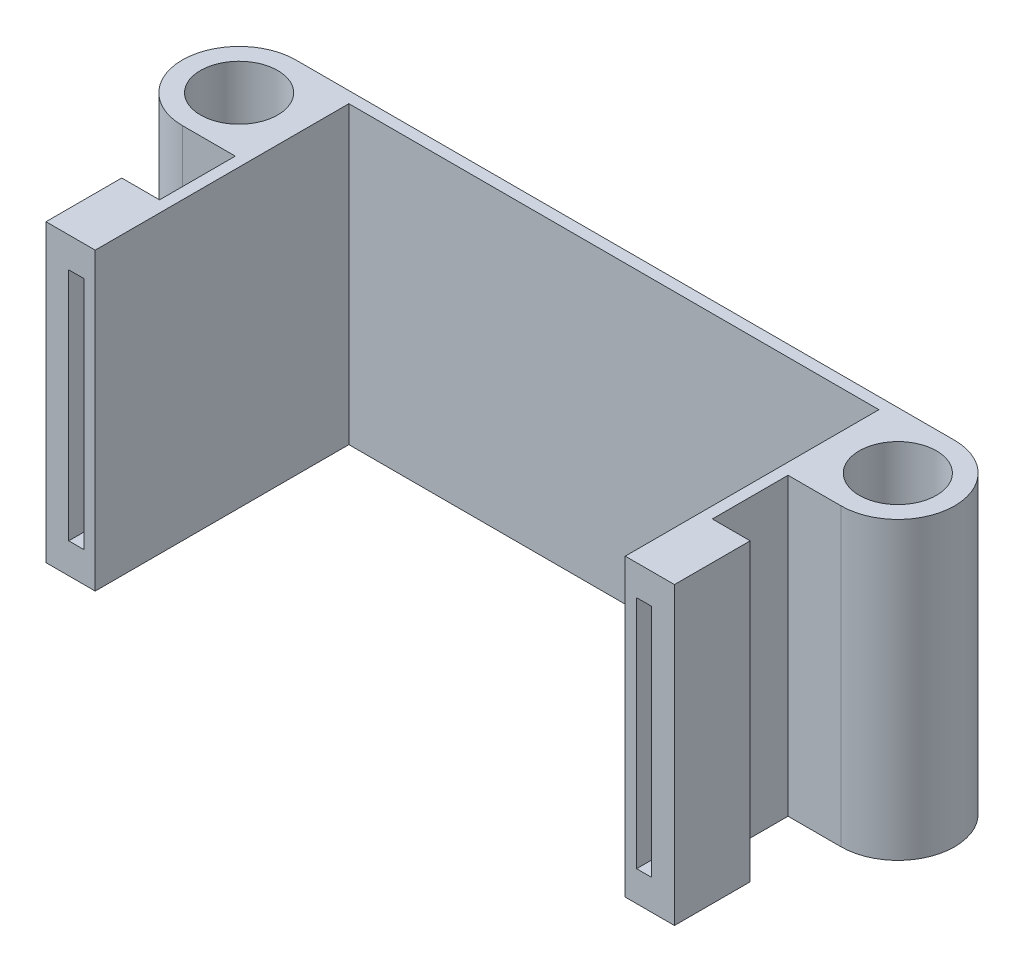
ISO-10303-21;
HEADER;
FILE_DESCRIPTION(('STEP AP214'),'2;1');
FILE_NAME('part.step','',(''),(''),'','','');
FILE_SCHEMA(('AUTOMOTIVE_DESIGN { 1 0 10303 214 1 1 1 1 }'));
ENDSEC;
DATA;
#1=APPLICATION_CONTEXT('core data for automotive mechanical design processes');
#2=APPLICATION_PROTOCOL_DEFINITION('international standard','automotive_design',2000,#1);
#3=PRODUCT_CONTEXT('',#1,'mechanical');
#4=PRODUCT('Part','Part','',(#3));
#5=PRODUCT_RELATED_PRODUCT_CATEGORY('part','',(#4));
#6=PRODUCT_DEFINITION_FORMATION('','',#4);
#7=PRODUCT_DEFINITION_CONTEXT('part definition',#1,'design');
#8=PRODUCT_DEFINITION('design','',#6,#7);
#9=PRODUCT_DEFINITION_SHAPE('','',#8);
#10=(LENGTH_UNIT() NAMED_UNIT(*) SI_UNIT(.MILLI.,.METRE.));
#11=(NAMED_UNIT(*) PLANE_ANGLE_UNIT() SI_UNIT($,.RADIAN.));
#12=(NAMED_UNIT(*) SI_UNIT($,.STERADIAN.) SOLID_ANGLE_UNIT());
#13=UNCERTAINTY_MEASURE_WITH_UNIT(LENGTH_MEASURE(1.E-05),#10,'distance_accuracy_value','');
#14=(GEOMETRIC_REPRESENTATION_CONTEXT(3) GLOBAL_UNCERTAINTY_ASSIGNED_CONTEXT((#13)) GLOBAL_UNIT_ASSIGNED_CONTEXT((#10,
#11,#12)) REPRESENTATION_CONTEXT('',''));
#15=CARTESIAN_POINT('',(0.,0.,0.));
#16=DIRECTION('',(0.,0.,1.));
#17=DIRECTION('',(1.,0.,0.));
#18=AXIS2_PLACEMENT_3D('',#15,#16,#17);
#19=CARTESIAN_POINT('',(0.,19.5,8.75));
#20=DIRECTION('',(0.,0.,-1.));
#21=DIRECTION('',(-1.,0.,0.));
#22=AXIS2_PLACEMENT_3D('',#19,#20,#21);
#23=PLANE('',#22);
#24=DIRECTION('',(-1.,0.,0.));
#25=VECTOR('',#24,1.);
#26=CARTESIAN_POINT('',(3.5,17.5,8.75));
#27=LINE('',#26,#25);
#28=CARTESIAN_POINT('',(3.5,17.5,8.75));
#29=VERTEX_POINT('',#28);
#30=CARTESIAN_POINT('',(2.5,17.5,8.75));
#31=VERTEX_POINT('',#30);
#32=EDGE_CURVE('E219',#29,#31,#27,.T.);
#33=ORIENTED_EDGE('',*,*,#32,.T.);
#34=DIRECTION('',(0.,-1.,0.));
#35=VECTOR('',#34,1.);
#36=CARTESIAN_POINT('',(2.5,17.5,8.75));
#37=LINE('',#36,#35);
#38=CARTESIAN_POINT('',(2.5,2.,8.75));
#39=VERTEX_POINT('',#38);
#40=EDGE_CURVE('E204',#31,#39,#37,.T.);
#41=ORIENTED_EDGE('',*,*,#40,.T.);
#42=DIRECTION('',(1.,0.,0.));
#43=VECTOR('',#42,1.);
#44=CARTESIAN_POINT('',(3.5,2.,8.75));
#45=LINE('',#44,#43);
#46=CARTESIAN_POINT('',(3.5,2.,8.75));
#47=VERTEX_POINT('',#46);
#48=EDGE_CURVE('E238',#39,#47,#45,.T.);
#49=ORIENTED_EDGE('',*,*,#48,.T.);
#50=DIRECTION('',(0.,-1.,0.));
#51=VECTOR('',#50,1.);
#52=CARTESIAN_POINT('',(3.5,19.5,8.75));
#53=LINE('',#52,#51);
#54=CARTESIAN_POINT('',(3.5,0.,8.75));
#55=VERTEX_POINT('',#54);
#56=EDGE_CURVE('E352',#47,#55,#53,.T.);
#57=ORIENTED_EDGE('',*,*,#56,.T.);
#58=DIRECTION('',(1.,0.,0.));
#59=VECTOR('',#58,1.);
#60=CARTESIAN_POINT('',(0.,0.,8.75));
#61=LINE('',#60,#59);
#62=CARTESIAN_POINT('',(0.999999999999997,0.,8.75));
#63=VERTEX_POINT('',#62);
#64=EDGE_CURVE('E249',#63,#55,#61,.T.);
#65=ORIENTED_EDGE('',*,*,#64,.F.);
#66=DIRECTION('',(0.,-1.,0.));
#67=VECTOR('',#66,1.);
#68=CARTESIAN_POINT('',(0.999999999999997,19.5,8.75));
#69=LINE('',#68,#67);
#70=CARTESIAN_POINT('',(0.999999999999997,19.5,8.75));
#71=VERTEX_POINT('',#70);
#72=EDGE_CURVE('E11',#71,#63,#69,.T.);
#73=ORIENTED_EDGE('',*,*,#72,.F.);
#74=DIRECTION('',(1.,0.,0.));
#75=VECTOR('',#74,1.);
#76=CARTESIAN_POINT('',(0.,19.5,8.75));
#77=LINE('',#76,#75);
#78=CARTESIAN_POINT('',(3.5,19.5,8.75));
#79=VERTEX_POINT('',#78);
#80=EDGE_CURVE('E288',#71,#79,#77,.T.);
#81=ORIENTED_EDGE('',*,*,#80,.T.);
#82=EDGE_CURVE('E228',#79,#29,#53,.T.);
#83=ORIENTED_EDGE('',*,*,#82,.T.);
#84=EDGE_LOOP('',(#33,#41,#49,#57,#65,#73,#81,#83));
#85=FACE_BOUND('',#84,.T.);
#86=ADVANCED_FACE('F43',(#85),#23,.T.);
#87=CARTESIAN_POINT('',(0.999999999999997,19.5,0.));
#88=DIRECTION('',(-1.,0.,0.));
#89=DIRECTION('',(0.,0.,1.));
#90=AXIS2_PLACEMENT_3D('',#87,#88,#89);
#91=PLANE('',#90);
#92=DIRECTION('',(0.,0.,-1.));
#93=VECTOR('',#92,1.);
#94=CARTESIAN_POINT('',(0.999999999999997,0.,0.));
#95=LINE('',#94,#93);
#96=CARTESIAN_POINT('',(0.999999999999998,0.,13.75));
#97=VERTEX_POINT('',#96);
#98=EDGE_CURVE('E356',#97,#63,#95,.T.);
#99=ORIENTED_EDGE('',*,*,#98,.F.);
#100=DIRECTION('',(0.,-1.,0.));
#101=VECTOR('',#100,1.);
#102=CARTESIAN_POINT('',(0.999999999999998,19.5,13.75));
#103=LINE('',#102,#101);
#104=CARTESIAN_POINT('',(0.999999999999998,19.5,13.75));
#105=VERTEX_POINT('',#104);
#106=EDGE_CURVE('E51',#105,#97,#103,.T.);
#107=ORIENTED_EDGE('',*,*,#106,.F.);
#108=DIRECTION('',(0.,0.,-1.));
#109=VECTOR('',#108,1.);
#110=CARTESIAN_POINT('',(0.999999999999997,19.5,0.));
#111=LINE('',#110,#109);
#112=EDGE_CURVE('E291',#105,#71,#111,.T.);
#113=ORIENTED_EDGE('',*,*,#112,.T.);
#114=ORIENTED_EDGE('',*,*,#72,.T.);
#115=EDGE_LOOP('',(#99,#107,#113,#114));
#116=FACE_BOUND('',#115,.T.);
#117=ADVANCED_FACE('F473',(#116),#91,.T.);
#118=CARTESIAN_POINT('',(0.,19.5,13.75));
#119=DIRECTION('',(0.,0.,1.));
#120=DIRECTION('',(1.,0.,0.));
#121=AXIS2_PLACEMENT_3D('',#118,#119,#120);
#122=PLANE('',#121);
#123=DIRECTION('',(-1.,0.,0.));
#124=VECTOR('',#123,1.);
#125=CARTESIAN_POINT('',(3.5,17.5,13.75));
#126=LINE('',#125,#124);
#127=CARTESIAN_POINT('',(3.5,17.5,13.75));
#128=VERTEX_POINT('',#127);
#129=CARTESIAN_POINT('',(2.5,17.5,13.75));
#130=VERTEX_POINT('',#129);
#131=EDGE_CURVE('E222',#128,#130,#126,.T.);
#132=ORIENTED_EDGE('',*,*,#131,.F.);
#133=DIRECTION('',(0.,1.,0.));
#134=VECTOR('',#133,1.);
#135=CARTESIAN_POINT('',(3.5,17.5,13.75));
#136=LINE('',#135,#134);
#137=CARTESIAN_POINT('',(3.5,2.,13.75));
#138=VERTEX_POINT('',#137);
#139=EDGE_CURVE('E236',#138,#128,#136,.T.);
#140=ORIENTED_EDGE('',*,*,#139,.F.);
#141=DIRECTION('',(1.,0.,0.));
#142=VECTOR('',#141,1.);
#143=CARTESIAN_POINT('',(3.5,2.,13.75));
#144=LINE('',#143,#142);
#145=CARTESIAN_POINT('',(2.5,2.,13.75));
#146=VERTEX_POINT('',#145);
#147=EDGE_CURVE('E58',#146,#138,#144,.T.);
#148=ORIENTED_EDGE('',*,*,#147,.F.);
#149=DIRECTION('',(0.,-1.,0.));
#150=VECTOR('',#149,1.);
#151=CARTESIAN_POINT('',(2.5,17.5,13.75));
#152=LINE('',#151,#150);
#153=EDGE_CURVE('E232',#130,#146,#152,.T.);
#154=ORIENTED_EDGE('',*,*,#153,.F.);
#155=EDGE_LOOP('',(#132,#140,#148,#154));
#156=FACE_BOUND('',#155,.T.);
#157=DIRECTION('',(-1.,0.,0.));
#158=VECTOR('',#157,1.);
#159=CARTESIAN_POINT('',(0.,0.,13.75));
#160=LINE('',#159,#158);
#161=CARTESIAN_POINT('',(4.25,0.,13.75));
#162=VERTEX_POINT('',#161);
#163=EDGE_CURVE('E360',#162,#97,#160,.T.);
#164=ORIENTED_EDGE('',*,*,#163,.F.);
#165=DIRECTION('',(0.,-1.,0.));
#166=VECTOR('',#165,1.);
#167=CARTESIAN_POINT('',(4.25,19.5,13.75));
#168=LINE('',#167,#166);
#169=CARTESIAN_POINT('',(4.25,19.5,13.75));
#170=VERTEX_POINT('',#169);
#171=EDGE_CURVE('E463',#170,#162,#168,.T.);
#172=ORIENTED_EDGE('',*,*,#171,.F.);
#173=DIRECTION('',(-1.,0.,0.));
#174=VECTOR('',#173,1.);
#175=CARTESIAN_POINT('',(0.,19.5,13.75));
#176=LINE('',#175,#174);
#177=EDGE_CURVE('E296',#170,#105,#176,.T.);
#178=ORIENTED_EDGE('',*,*,#177,.T.);
#179=ORIENTED_EDGE('',*,*,#106,.T.);
#180=EDGE_LOOP('',(#164,#172,#178,#179));
#181=FACE_BOUND('',#180,.T.);
#182=ADVANCED_FACE('F469',(#156,#181),#122,.T.);
#183=CARTESIAN_POINT('',(4.25,19.5,0.));
#184=DIRECTION('',(1.,0.,0.));
#185=DIRECTION('',(0.,0.,-1.));
#186=AXIS2_PLACEMENT_3D('',#183,#184,#185);
#187=PLANE('',#186);
#188=DIRECTION('',(0.,0.,1.));
#189=VECTOR('',#188,1.);
#190=CARTESIAN_POINT('',(4.25,0.,0.));
#191=LINE('',#190,#189);
#192=CARTESIAN_POINT('',(4.25,0.,-2.99999999999993));
#193=VERTEX_POINT('',#192);
#194=EDGE_CURVE('E364',#193,#162,#191,.T.);
#195=ORIENTED_EDGE('',*,*,#194,.F.);
#196=DIRECTION('',(0.,-1.,0.));
#197=VECTOR('',#196,1.);
#198=CARTESIAN_POINT('',(4.25,19.5,-2.99999999999993));
#199=LINE('',#198,#197);
#200=CARTESIAN_POINT('',(4.25,19.5,-2.99999999999993));
#201=VERTEX_POINT('',#200);
#202=EDGE_CURVE('E460',#201,#193,#199,.T.);
#203=ORIENTED_EDGE('',*,*,#202,.F.);
#204=DIRECTION('',(0.,0.,1.));
#205=VECTOR('',#204,1.);
#206=CARTESIAN_POINT('',(4.25,19.5,0.));
#207=LINE('',#206,#205);
#208=EDGE_CURVE('E300',#201,#170,#207,.T.);
#209=ORIENTED_EDGE('',*,*,#208,.T.);
#210=ORIENTED_EDGE('',*,*,#171,.T.);
#211=EDGE_LOOP('',(#195,#203,#209,#210));
#212=FACE_BOUND('',#211,.T.);
#213=ADVANCED_FACE('F482',(#212),#187,.T.);
#214=CARTESIAN_POINT('',(0.,19.5,-2.99999999999993));
#215=DIRECTION('',(0.,0.,-1.));
#216=DIRECTION('',(-1.,0.,0.));
#217=AXIS2_PLACEMENT_3D('',#214,#215,#216);
#218=PLANE('',#217);
#219=DIRECTION('',(1.,0.,0.));
#220=VECTOR('',#219,1.);
#221=CARTESIAN_POINT('',(0.,0.,-2.99999999999993));
#222=LINE('',#221,#220);
#223=CARTESIAN_POINT('',(39.25,0.,-2.99999999999993));
#224=VERTEX_POINT('',#223);
#225=EDGE_CURVE('E368',#193,#224,#222,.T.);
#226=ORIENTED_EDGE('',*,*,#225,.T.);
#227=DIRECTION('',(0.,-1.,0.));
#228=VECTOR('',#227,1.);
#229=CARTESIAN_POINT('',(39.25,19.5,-2.99999999999993));
#230=LINE('',#229,#228);
#231=CARTESIAN_POINT('',(39.25,19.5,-2.99999999999993));
#232=VERTEX_POINT('',#231);
#233=EDGE_CURVE('E456',#232,#224,#230,.T.);
#234=ORIENTED_EDGE('',*,*,#233,.F.);
#235=DIRECTION('',(1.,0.,0.));
#236=VECTOR('',#235,1.);
#237=CARTESIAN_POINT('',(0.,19.5,-2.99999999999993));
#238=LINE('',#237,#236);
#239=EDGE_CURVE('E304',#201,#232,#238,.T.);
#240=ORIENTED_EDGE('',*,*,#239,.F.);
#241=ORIENTED_EDGE('',*,*,#202,.T.);
#242=EDGE_LOOP('',(#226,#234,#240,#241));
#243=FACE_BOUND('',#242,.T.);
#244=ADVANCED_FACE('F539',(#243),#218,.F.);
#245=CARTESIAN_POINT('',(39.25,19.5,0.));
#246=DIRECTION('',(1.,0.,0.));
#247=DIRECTION('',(0.,0.,-1.));
#248=AXIS2_PLACEMENT_3D('',#245,#246,#247);
#249=PLANE('',#248);
#250=DIRECTION('',(0.,0.,1.));
#251=VECTOR('',#250,1.);
#252=CARTESIAN_POINT('',(39.25,0.,0.));
#253=LINE('',#252,#251);
#254=CARTESIAN_POINT('',(39.25,0.,13.75));
#255=VERTEX_POINT('',#254);
#256=EDGE_CURVE('E371',#224,#255,#253,.T.);
#257=ORIENTED_EDGE('',*,*,#256,.T.);
#258=DIRECTION('',(0.,-1.,0.));
#259=VECTOR('',#258,1.);
#260=CARTESIAN_POINT('',(39.25,19.5,13.75));
#261=LINE('',#260,#259);
#262=CARTESIAN_POINT('',(39.25,19.5,13.75));
#263=VERTEX_POINT('',#262);
#264=EDGE_CURVE('E453',#263,#255,#261,.T.);
#265=ORIENTED_EDGE('',*,*,#264,.F.);
#266=DIRECTION('',(0.,0.,1.));
#267=VECTOR('',#266,1.);
#268=CARTESIAN_POINT('',(39.25,19.5,0.));
#269=LINE('',#268,#267);
#270=EDGE_CURVE('E307',#232,#263,#269,.T.);
#271=ORIENTED_EDGE('',*,*,#270,.F.);
#272=ORIENTED_EDGE('',*,*,#233,.T.);
#273=EDGE_LOOP('',(#257,#265,#271,#272));
#274=FACE_BOUND('',#273,.T.);
#275=ADVANCED_FACE('F536',(#274),#249,.F.);
#276=CARTESIAN_POINT('',(0.,19.5,13.75));
#277=DIRECTION('',(0.,0.,1.));
#278=DIRECTION('',(1.,0.,0.));
#279=AXIS2_PLACEMENT_3D('',#276,#277,#278);
#280=PLANE('',#279);
#281=DIRECTION('',(-1.,0.,0.));
#282=VECTOR('',#281,1.);
#283=CARTESIAN_POINT('',(41.,17.5,13.75));
#284=LINE('',#283,#282);
#285=CARTESIAN_POINT('',(41.,17.5,13.75));
#286=VERTEX_POINT('',#285);
#287=CARTESIAN_POINT('',(40.,17.5,13.75));
#288=VERTEX_POINT('',#287);
#289=EDGE_CURVE('E257',#286,#288,#284,.T.);
#290=ORIENTED_EDGE('',*,*,#289,.F.);
#291=DIRECTION('',(0.,1.,0.));
#292=VECTOR('',#291,1.);
#293=CARTESIAN_POINT('',(41.,17.5,13.75));
#294=LINE('',#293,#292);
#295=CARTESIAN_POINT('',(41.,2.,13.75));
#296=VERTEX_POINT('',#295);
#297=EDGE_CURVE('E261',#296,#286,#294,.T.);
#298=ORIENTED_EDGE('',*,*,#297,.F.);
#299=DIRECTION('',(1.,0.,0.));
#300=VECTOR('',#299,1.);
#301=CARTESIAN_POINT('',(41.,2.,13.75));
#302=LINE('',#301,#300);
#303=CARTESIAN_POINT('',(40.,2.,13.75));
#304=VERTEX_POINT('',#303);
#305=EDGE_CURVE('E66',#304,#296,#302,.T.);
#306=ORIENTED_EDGE('',*,*,#305,.F.);
#307=DIRECTION('',(0.,-1.,0.));
#308=VECTOR('',#307,1.);
#309=CARTESIAN_POINT('',(40.,17.5,13.75));
#310=LINE('',#309,#308);
#311=EDGE_CURVE('E253',#288,#304,#310,.T.);
#312=ORIENTED_EDGE('',*,*,#311,.F.);
#313=EDGE_LOOP('',(#290,#298,#306,#312));
#314=FACE_BOUND('',#313,.T.);
#315=DIRECTION('',(-1.,0.,0.));
#316=VECTOR('',#315,1.);
#317=CARTESIAN_POINT('',(0.,0.,13.75));
#318=LINE('',#317,#316);
#319=CARTESIAN_POINT('',(42.5,0.,13.75));
#320=VERTEX_POINT('',#319);
#321=EDGE_CURVE('E375',#320,#255,#318,.T.);
#322=ORIENTED_EDGE('',*,*,#321,.F.);
#323=DIRECTION('',(0.,-1.,0.));
#324=VECTOR('',#323,1.);
#325=CARTESIAN_POINT('',(42.5,19.5,13.75));
#326=LINE('',#325,#324);
#327=CARTESIAN_POINT('',(42.5,19.5,13.75));
#328=VERTEX_POINT('',#327);
#329=EDGE_CURVE('E450',#328,#320,#326,.T.);
#330=ORIENTED_EDGE('',*,*,#329,.F.);
#331=DIRECTION('',(-1.,0.,0.));
#332=VECTOR('',#331,1.);
#333=CARTESIAN_POINT('',(0.,19.5,13.75));
#334=LINE('',#333,#332);
#335=EDGE_CURVE('E310',#328,#263,#334,.T.);
#336=ORIENTED_EDGE('',*,*,#335,.T.);
#337=ORIENTED_EDGE('',*,*,#264,.T.);
#338=EDGE_LOOP('',(#322,#330,#336,#337));
#339=FACE_BOUND('',#338,.T.);
#340=ADVANCED_FACE('F530',(#314,#339),#280,.T.);
#341=CARTESIAN_POINT('',(42.5,19.5,0.));
#342=DIRECTION('',(-1.,0.,0.));
#343=DIRECTION('',(0.,0.,1.));
#344=AXIS2_PLACEMENT_3D('',#341,#342,#343);
#345=PLANE('',#344);
#346=DIRECTION('',(0.,0.,-1.));
#347=VECTOR('',#346,1.);
#348=CARTESIAN_POINT('',(42.5,0.,0.));
#349=LINE('',#348,#347);
#350=CARTESIAN_POINT('',(42.5,0.,8.75));
#351=VERTEX_POINT('',#350);
#352=EDGE_CURVE('E379',#320,#351,#349,.T.);
#353=ORIENTED_EDGE('',*,*,#352,.T.);
#354=DIRECTION('',(0.,-1.,0.));
#355=VECTOR('',#354,1.);
#356=CARTESIAN_POINT('',(42.5,19.5,8.75));
#357=LINE('',#356,#355);
#358=CARTESIAN_POINT('',(42.5,19.5,8.75));
#359=VERTEX_POINT('',#358);
#360=EDGE_CURVE('E446',#359,#351,#357,.T.);
#361=ORIENTED_EDGE('',*,*,#360,.F.);
#362=DIRECTION('',(0.,0.,-1.));
#363=VECTOR('',#362,1.);
#364=CARTESIAN_POINT('',(42.5,19.5,0.));
#365=LINE('',#364,#363);
#366=EDGE_CURVE('E314',#328,#359,#365,.T.);
#367=ORIENTED_EDGE('',*,*,#366,.F.);
#368=ORIENTED_EDGE('',*,*,#329,.T.);
#369=EDGE_LOOP('',(#353,#361,#367,#368));
#370=FACE_BOUND('',#369,.T.);
#371=ADVANCED_FACE('F542',(#370),#345,.F.);
#372=CARTESIAN_POINT('',(0.,19.5,8.75));
#373=DIRECTION('',(0.,0.,1.));
#374=DIRECTION('',(1.,0.,0.));
#375=AXIS2_PLACEMENT_3D('',#372,#373,#374);
#376=PLANE('',#375);
#377=DIRECTION('',(0.,1.,0.));
#378=VECTOR('',#377,1.);
#379=CARTESIAN_POINT('',(41.,17.5,8.75));
#380=LINE('',#379,#378);
#381=CARTESIAN_POINT('',(41.,2.,8.75));
#382=VERTEX_POINT('',#381);
#383=CARTESIAN_POINT('',(41.,17.5,8.75));
#384=VERTEX_POINT('',#383);
#385=EDGE_CURVE('E269',#382,#384,#380,.T.);
#386=ORIENTED_EDGE('',*,*,#385,.T.);
#387=DIRECTION('',(-1.,0.,0.));
#388=VECTOR('',#387,1.);
#389=CARTESIAN_POINT('',(41.,17.5,8.75));
#390=LINE('',#389,#388);
#391=CARTESIAN_POINT('',(40.,17.5,8.75));
#392=VERTEX_POINT('',#391);
#393=EDGE_CURVE('E252',#384,#392,#390,.T.);
#394=ORIENTED_EDGE('',*,*,#393,.T.);
#395=DIRECTION('',(0.,-1.,0.));
#396=VECTOR('',#395,1.);
#397=CARTESIAN_POINT('',(40.,19.5,8.75));
#398=LINE('',#397,#396);
#399=CARTESIAN_POINT('',(40.,19.5,8.75));
#400=VERTEX_POINT('',#399);
#401=EDGE_CURVE('E442',#400,#392,#398,.T.);
#402=ORIENTED_EDGE('',*,*,#401,.F.);
#403=DIRECTION('',(-1.,0.,0.));
#404=VECTOR('',#403,1.);
#405=CARTESIAN_POINT('',(0.,19.5,8.75));
#406=LINE('',#405,#404);
#407=EDGE_CURVE('E317',#359,#400,#406,.T.);
#408=ORIENTED_EDGE('',*,*,#407,.F.);
#409=ORIENTED_EDGE('',*,*,#360,.T.);
#410=DIRECTION('',(-1.,0.,0.));
#411=VECTOR('',#410,1.);
#412=CARTESIAN_POINT('',(0.,0.,8.75));
#413=LINE('',#412,#411);
#414=CARTESIAN_POINT('',(40.,0.,8.75));
#415=VERTEX_POINT('',#414);
#416=EDGE_CURVE('E382',#351,#415,#413,.T.);
#417=ORIENTED_EDGE('',*,*,#416,.T.);
#418=CARTESIAN_POINT('',(40.,2.,8.75));
#419=VERTEX_POINT('',#418);
#420=EDGE_CURVE('E441',#419,#415,#398,.T.);
#421=ORIENTED_EDGE('',*,*,#420,.F.);
#422=DIRECTION('',(1.,0.,0.));
#423=VECTOR('',#422,1.);
#424=CARTESIAN_POINT('',(41.,2.,8.75));
#425=LINE('',#424,#423);
#426=EDGE_CURVE('E275',#419,#382,#425,.T.);
#427=ORIENTED_EDGE('',*,*,#426,.T.);
#428=EDGE_LOOP('',(#386,#394,#402,#408,#409,#417,#421,#427));
#429=FACE_BOUND('',#428,.T.);
#430=ADVANCED_FACE('F523',(#429),#376,.F.);
#431=CARTESIAN_POINT('',(40.,19.5,0.));
#432=DIRECTION('',(1.,0.,0.));
#433=DIRECTION('',(0.,0.,-1.));
#434=AXIS2_PLACEMENT_3D('',#431,#432,#433);
#435=PLANE('',#434);
#436=DIRECTION('',(0.,0.,1.));
#437=VECTOR('',#436,1.);
#438=CARTESIAN_POINT('',(40.,0.,0.));
#439=LINE('',#438,#437);
#440=CARTESIAN_POINT('',(40.,0.,3.75));
#441=VERTEX_POINT('',#440);
#442=EDGE_CURVE('E386',#441,#415,#439,.T.);
#443=ORIENTED_EDGE('',*,*,#442,.F.);
#444=DIRECTION('',(0.,-1.,0.));
#445=VECTOR('',#444,1.);
#446=CARTESIAN_POINT('',(40.,19.5,3.75));
#447=LINE('',#446,#445);
#448=CARTESIAN_POINT('',(40.,19.5,3.75));
#449=VERTEX_POINT('',#448);
#450=EDGE_CURVE('E438',#449,#441,#447,.T.);
#451=ORIENTED_EDGE('',*,*,#450,.F.);
#452=DIRECTION('',(0.,0.,1.));
#453=VECTOR('',#452,1.);
#454=CARTESIAN_POINT('',(40.,19.5,0.));
#455=LINE('',#454,#453);
#456=EDGE_CURVE('E320',#449,#400,#455,.T.);
#457=ORIENTED_EDGE('',*,*,#456,.T.);
#458=ORIENTED_EDGE('',*,*,#401,.T.);
#459=DIRECTION('',(0.,0.,1.));
#460=VECTOR('',#459,1.);
#461=CARTESIAN_POINT('',(40.,17.5,-6.78222456700907));
#462=LINE('',#461,#460);
#463=EDGE_CURVE('E268',#392,#288,#462,.T.);
#464=ORIENTED_EDGE('',*,*,#463,.T.);
#465=ORIENTED_EDGE('',*,*,#311,.T.);
#466=DIRECTION('',(0.,0.,1.));
#467=VECTOR('',#466,1.);
#468=CARTESIAN_POINT('',(40.,2.,-6.78222456700907));
#469=LINE('',#468,#467);
#470=EDGE_CURVE('E279',#419,#304,#469,.T.);
#471=ORIENTED_EDGE('',*,*,#470,.F.);
#472=ORIENTED_EDGE('',*,*,#420,.T.);
#473=EDGE_LOOP('',(#443,#451,#457,#458,#464,#465,#471,#472));
#474=FACE_BOUND('',#473,.T.);
#475=ADVANCED_FACE('F517',(#474),#435,.T.);
#476=CARTESIAN_POINT('',(0.,19.5,3.74999999999938));
#477=DIRECTION('',(0.,0.,-1.));
#478=DIRECTION('',(-1.,0.,0.));
#479=AXIS2_PLACEMENT_3D('',#476,#477,#478);
#480=PLANE('',#479);
#481=DIRECTION('',(1.,0.,0.));
#482=VECTOR('',#481,1.);
#483=CARTESIAN_POINT('',(0.,0.,3.74999999999938));
#484=LINE('',#483,#482);
#485=CARTESIAN_POINT('',(43.5000000000001,0.,3.75000000000006));
#486=VERTEX_POINT('',#485);
#487=EDGE_CURVE('E390',#441,#486,#484,.T.);
#488=ORIENTED_EDGE('',*,*,#487,.T.);
#489=DIRECTION('',(0.,-1.,0.));
#490=VECTOR('',#489,1.);
#491=CARTESIAN_POINT('',(43.5000000000001,19.5,3.75000000000006));
#492=LINE('',#491,#490);
#493=CARTESIAN_POINT('',(43.5000000000001,19.5,3.75000000000006));
#494=VERTEX_POINT('',#493);
#495=EDGE_CURVE('E434',#494,#486,#492,.T.);
#496=ORIENTED_EDGE('',*,*,#495,.F.);
#497=DIRECTION('',(1.,0.,0.));
#498=VECTOR('',#497,1.);
#499=CARTESIAN_POINT('',(0.,19.5,3.74999999999938));
#500=LINE('',#499,#498);
#501=EDGE_CURVE('E324',#449,#494,#500,.T.);
#502=ORIENTED_EDGE('',*,*,#501,.F.);
#503=ORIENTED_EDGE('',*,*,#450,.T.);
#504=EDGE_LOOP('',(#488,#496,#502,#503));
#505=FACE_BOUND('',#504,.T.);
#506=ADVANCED_FACE('F543',(#505),#480,.F.);
#507=CARTESIAN_POINT('',(43.5000000000001,19.5,0.));
#508=DIRECTION('',(0.,-1.,0.));
#509=DIRECTION('',(0.,0.,-1.));
#510=AXIS2_PLACEMENT_3D('',#507,#508,#509);
#511=CYLINDRICAL_SURFACE('',#510,3.75000000000006);
#512=CARTESIAN_POINT('',(43.5000000000001,0.,0.));
#513=DIRECTION('',(0.,1.,0.));
#514=DIRECTION('',(0.,0.,1.));
#515=AXIS2_PLACEMENT_3D('',#512,#513,#514);
#516=CIRCLE('',#515,3.75000000000006);
#517=CARTESIAN_POINT('',(43.5,0.,-3.75000000000004));
#518=VERTEX_POINT('',#517);
#519=EDGE_CURVE('E393',#486,#518,#516,.T.);
#520=ORIENTED_EDGE('',*,*,#519,.T.);
#521=DIRECTION('',(0.,-1.,0.));
#522=VECTOR('',#521,1.);
#523=CARTESIAN_POINT('',(43.5,19.5,-3.75000000000004));
#524=LINE('',#523,#522);
#525=CARTESIAN_POINT('',(43.5,19.5,-3.75000000000004));
#526=VERTEX_POINT('',#525);
#527=EDGE_CURVE('E431',#526,#518,#524,.T.);
#528=ORIENTED_EDGE('',*,*,#527,.F.);
#529=CARTESIAN_POINT('',(43.5000000000001,19.5,0.));
#530=DIRECTION('',(0.,1.,0.));
#531=DIRECTION('',(0.,0.,1.));
#532=AXIS2_PLACEMENT_3D('',#529,#530,#531);
#533=CIRCLE('',#532,3.75000000000006);
#534=EDGE_CURVE('E327',#494,#526,#533,.T.);
#535=ORIENTED_EDGE('',*,*,#534,.F.);
#536=ORIENTED_EDGE('',*,*,#495,.T.);
#537=EDGE_LOOP('',(#520,#528,#535,#536));
#538=FACE_BOUND('',#537,.T.);
#539=ADVANCED_FACE('F510',(#538),#511,.T.);
#540=CARTESIAN_POINT('',(0.,19.5,-3.75));
#541=DIRECTION('',(0.,0.,-1.));
#542=DIRECTION('',(-1.,0.,0.));
#543=AXIS2_PLACEMENT_3D('',#540,#541,#542);
#544=PLANE('',#543);
#545=DIRECTION('',(1.,0.,0.));
#546=VECTOR('',#545,1.);
#547=CARTESIAN_POINT('',(0.,0.,-3.75));
#548=LINE('',#547,#546);
#549=CARTESIAN_POINT('',(0.,0.,-3.75));
#550=VERTEX_POINT('',#549);
#551=EDGE_CURVE('E397',#550,#518,#548,.T.);
#552=ORIENTED_EDGE('',*,*,#551,.F.);
#553=DIRECTION('',(0.,-1.,0.));
#554=VECTOR('',#553,1.);
#555=CARTESIAN_POINT('',(0.,19.5,-3.75));
#556=LINE('',#555,#554);
#557=CARTESIAN_POINT('',(0.,19.5,-3.75));
#558=VERTEX_POINT('',#557);
#559=EDGE_CURVE('E428',#558,#550,#556,.T.);
#560=ORIENTED_EDGE('',*,*,#559,.F.);
#561=DIRECTION('',(1.,0.,0.));
#562=VECTOR('',#561,1.);
#563=CARTESIAN_POINT('',(0.,19.5,-3.75));
#564=LINE('',#563,#562);
#565=EDGE_CURVE('E330',#558,#526,#564,.T.);
#566=ORIENTED_EDGE('',*,*,#565,.T.);
#567=ORIENTED_EDGE('',*,*,#527,.T.);
#568=EDGE_LOOP('',(#552,#560,#566,#567));
#569=FACE_BOUND('',#568,.T.);
#570=ADVANCED_FACE('F505',(#569),#544,.T.);
#571=CARTESIAN_POINT('',(0.,19.5,0.));
#572=DIRECTION('',(0.,-1.,0.));
#573=DIRECTION('',(0.,0.,-1.));
#574=AXIS2_PLACEMENT_3D('',#571,#572,#573);
#575=CYLINDRICAL_SURFACE('',#574,3.75);
#576=CARTESIAN_POINT('',(0.,0.,0.));
#577=DIRECTION('',(0.,1.,0.));
#578=DIRECTION('',(0.,0.,1.));
#579=AXIS2_PLACEMENT_3D('',#576,#577,#578);
#580=CIRCLE('',#579,3.75);
#581=CARTESIAN_POINT('',(0.,0.,3.75));
#582=VERTEX_POINT('',#581);
#583=EDGE_CURVE('E401',#550,#582,#580,.T.);
#584=ORIENTED_EDGE('',*,*,#583,.T.);
#585=DIRECTION('',(0.,-1.,0.));
#586=VECTOR('',#585,1.);
#587=CARTESIAN_POINT('',(0.,19.5,3.75));
#588=LINE('',#587,#586);
#589=CARTESIAN_POINT('',(0.,19.5,3.75));
#590=VERTEX_POINT('',#589);
#591=EDGE_CURVE('E425',#590,#582,#588,.T.);
#592=ORIENTED_EDGE('',*,*,#591,.F.);
#593=CARTESIAN_POINT('',(0.,19.5,0.));
#594=DIRECTION('',(0.,1.,0.));
#595=DIRECTION('',(0.,0.,1.));
#596=AXIS2_PLACEMENT_3D('',#593,#594,#595);
#597=CIRCLE('',#596,3.75);
#598=EDGE_CURVE('E334',#558,#590,#597,.T.);
#599=ORIENTED_EDGE('',*,*,#598,.F.);
#600=ORIENTED_EDGE('',*,*,#559,.T.);
#601=EDGE_LOOP('',(#584,#592,#599,#600));
#602=FACE_BOUND('',#601,.T.);
#603=ADVANCED_FACE('F501',(#602),#575,.T.);
#604=CARTESIAN_POINT('',(0.,19.5,3.75));
#605=DIRECTION('',(0.,0.,1.));
#606=DIRECTION('',(1.,0.,0.));
#607=AXIS2_PLACEMENT_3D('',#604,#605,#606);
#608=PLANE('',#607);
#609=DIRECTION('',(-1.,0.,0.));
#610=VECTOR('',#609,1.);
#611=CARTESIAN_POINT('',(0.,0.,3.75));
#612=LINE('',#611,#610);
#613=CARTESIAN_POINT('',(3.5,0.,3.75));
#614=VERTEX_POINT('',#613);
#615=EDGE_CURVE('E405',#614,#582,#612,.T.);
#616=ORIENTED_EDGE('',*,*,#615,.F.);
#617=DIRECTION('',(0.,-1.,0.));
#618=VECTOR('',#617,1.);
#619=CARTESIAN_POINT('',(3.5,19.5,3.75));
#620=LINE('',#619,#618);
#621=CARTESIAN_POINT('',(3.5,19.5,3.75));
#622=VERTEX_POINT('',#621);
#623=EDGE_CURVE('E422',#622,#614,#620,.T.);
#624=ORIENTED_EDGE('',*,*,#623,.F.);
#625=DIRECTION('',(-1.,0.,0.));
#626=VECTOR('',#625,1.);
#627=CARTESIAN_POINT('',(0.,19.5,3.75));
#628=LINE('',#627,#626);
#629=EDGE_CURVE('E337',#622,#590,#628,.T.);
#630=ORIENTED_EDGE('',*,*,#629,.T.);
#631=ORIENTED_EDGE('',*,*,#591,.T.);
#632=EDGE_LOOP('',(#616,#624,#630,#631));
#633=FACE_BOUND('',#632,.T.);
#634=ADVANCED_FACE('F497',(#633),#608,.T.);
#635=CARTESIAN_POINT('',(0.,19.5,0.));
#636=DIRECTION('',(0.,-1.,0.));
#637=DIRECTION('',(0.,0.,-1.));
#638=AXIS2_PLACEMENT_3D('',#635,#636,#637);
#639=CYLINDRICAL_SURFACE('',#638,2.55);
#640=CARTESIAN_POINT('',(0.,19.5,0.));
#641=DIRECTION('',(0.,1.,0.));
#642=DIRECTION('',(0.,0.,1.));
#643=AXIS2_PLACEMENT_3D('',#640,#641,#642);
#644=CIRCLE('',#643,2.55);
#645=CARTESIAN_POINT('',(0.,19.5,2.55));
#646=VERTEX_POINT('',#645);
#647=EDGE_CURVE('E344',#646,#646,#644,.T.);
#648=ORIENTED_EDGE('',*,*,#647,.T.);
#649=EDGE_LOOP('',(#648));
#650=FACE_BOUND('',#649,.T.);
#651=CARTESIAN_POINT('',(0.,0.,0.));
#652=DIRECTION('',(0.,1.,0.));
#653=DIRECTION('',(0.,0.,1.));
#654=AXIS2_PLACEMENT_3D('',#651,#652,#653);
#655=CIRCLE('',#654,2.55);
#656=CARTESIAN_POINT('',(0.,0.,2.55));
#657=VERTEX_POINT('',#656);
#658=EDGE_CURVE('E413',#657,#657,#655,.T.);
#659=ORIENTED_EDGE('',*,*,#658,.F.);
#660=EDGE_LOOP('',(#659));
#661=FACE_BOUND('',#660,.T.);
#662=ADVANCED_FACE('F596',(#650,#661),#639,.F.);
#663=CARTESIAN_POINT('',(3.5,19.5,0.));
#664=DIRECTION('',(1.,0.,0.));
#665=DIRECTION('',(0.,0.,-1.));
#666=AXIS2_PLACEMENT_3D('',#663,#664,#665);
#667=PLANE('',#666);
#668=DIRECTION('',(0.,0.,1.));
#669=VECTOR('',#668,1.);
#670=CARTESIAN_POINT('',(3.5,0.,0.));
#671=LINE('',#670,#669);
#672=EDGE_CURVE('E409',#614,#55,#671,.T.);
#673=ORIENTED_EDGE('',*,*,#672,.T.);
#674=ORIENTED_EDGE('',*,*,#56,.F.);
#675=DIRECTION('',(0.,0.,1.));
#676=VECTOR('',#675,1.);
#677=CARTESIAN_POINT('',(3.5,2.,-6.78222456700907));
#678=LINE('',#677,#676);
#679=EDGE_CURVE('E240',#47,#138,#678,.T.);
#680=ORIENTED_EDGE('',*,*,#679,.T.);
#681=ORIENTED_EDGE('',*,*,#139,.T.);
#682=DIRECTION('',(0.,0.,1.));
#683=VECTOR('',#682,1.);
#684=CARTESIAN_POINT('',(3.5,17.5,-6.78222456700907));
#685=LINE('',#684,#683);
#686=EDGE_CURVE('E244',#29,#128,#685,.T.);
#687=ORIENTED_EDGE('',*,*,#686,.F.);
#688=ORIENTED_EDGE('',*,*,#82,.F.);
#689=DIRECTION('',(0.,0.,1.));
#690=VECTOR('',#689,1.);
#691=CARTESIAN_POINT('',(3.5,19.5,0.));
#692=LINE('',#691,#690);
#693=EDGE_CURVE('E341',#622,#79,#692,.T.);
#694=ORIENTED_EDGE('',*,*,#693,.F.);
#695=ORIENTED_EDGE('',*,*,#623,.T.);
#696=EDGE_LOOP('',(#673,#674,#680,#681,#687,#688,#694,#695));
#697=FACE_BOUND('',#696,.T.);
#698=ADVANCED_FACE('F591',(#697),#667,.F.);
#699=CARTESIAN_POINT('',(43.5000000000001,19.5,0.));
#700=DIRECTION('',(0.,-1.,0.));
#701=DIRECTION('',(0.,0.,-1.));
#702=AXIS2_PLACEMENT_3D('',#699,#700,#701);
#703=CYLINDRICAL_SURFACE('',#702,2.55);
#704=CARTESIAN_POINT('',(43.5000000000001,19.5,0.));
#705=DIRECTION('',(0.,1.,0.));
#706=DIRECTION('',(0.,0.,1.));
#707=AXIS2_PLACEMENT_3D('',#704,#705,#706);
#708=CIRCLE('',#707,2.55);
#709=CARTESIAN_POINT('',(43.5000000000001,19.5,2.54999999999999));
#710=VERTEX_POINT('',#709);
#711=EDGE_CURVE('E348',#710,#710,#708,.T.);
#712=ORIENTED_EDGE('',*,*,#711,.T.);
#713=EDGE_LOOP('',(#712));
#714=FACE_BOUND('',#713,.T.);
#715=CARTESIAN_POINT('',(43.5000000000001,0.,0.));
#716=DIRECTION('',(0.,1.,0.));
#717=DIRECTION('',(0.,0.,1.));
#718=AXIS2_PLACEMENT_3D('',#715,#716,#717);
#719=CIRCLE('',#718,2.55);
#720=CARTESIAN_POINT('',(43.5000000000001,0.,2.54999999999999));
#721=VERTEX_POINT('',#720);
#722=EDGE_CURVE('E292',#721,#721,#719,.T.);
#723=ORIENTED_EDGE('',*,*,#722,.F.);
#724=EDGE_LOOP('',(#723));
#725=FACE_BOUND('',#724,.T.);
#726=ADVANCED_FACE('F595',(#714,#725),#703,.F.);
#727=CARTESIAN_POINT('',(0.,19.5,0.));
#728=DIRECTION('',(0.,1.,0.));
#729=DIRECTION('',(0.,0.,1.));
#730=AXIS2_PLACEMENT_3D('',#727,#728,#729);
#731=PLANE('',#730);
#732=ORIENTED_EDGE('',*,*,#80,.F.);
#733=ORIENTED_EDGE('',*,*,#112,.F.);
#734=ORIENTED_EDGE('',*,*,#177,.F.);
#735=ORIENTED_EDGE('',*,*,#208,.F.);
#736=ORIENTED_EDGE('',*,*,#239,.T.);
#737=ORIENTED_EDGE('',*,*,#270,.T.);
#738=ORIENTED_EDGE('',*,*,#335,.F.);
#739=ORIENTED_EDGE('',*,*,#366,.T.);
#740=ORIENTED_EDGE('',*,*,#407,.T.);
#741=ORIENTED_EDGE('',*,*,#456,.F.);
#742=ORIENTED_EDGE('',*,*,#501,.T.);
#743=ORIENTED_EDGE('',*,*,#534,.T.);
#744=ORIENTED_EDGE('',*,*,#565,.F.);
#745=ORIENTED_EDGE('',*,*,#598,.T.);
#746=ORIENTED_EDGE('',*,*,#629,.F.);
#747=ORIENTED_EDGE('',*,*,#693,.T.);
#748=EDGE_LOOP('',(#732,#733,#734,#735,#736,#737,#738,#739,#740,#741,#742,#743,#744,#745,#746,#747));
#749=FACE_BOUND('',#748,.T.);
#750=ORIENTED_EDGE('',*,*,#647,.F.);
#751=EDGE_LOOP('',(#750));
#752=FACE_BOUND('',#751,.T.);
#753=ORIENTED_EDGE('',*,*,#711,.F.);
#754=EDGE_LOOP('',(#753));
#755=FACE_BOUND('',#754,.T.);
#756=ADVANCED_FACE('F487',(#749,#752,#755),#731,.T.);
#757=CARTESIAN_POINT('',(0.,0.,0.));
#758=DIRECTION('',(0.,1.,0.));
#759=DIRECTION('',(0.,0.,1.));
#760=AXIS2_PLACEMENT_3D('',#757,#758,#759);
#761=PLANE('',#760);
#762=ORIENTED_EDGE('',*,*,#64,.T.);
#763=ORIENTED_EDGE('',*,*,#672,.F.);
#764=ORIENTED_EDGE('',*,*,#615,.T.);
#765=ORIENTED_EDGE('',*,*,#583,.F.);
#766=ORIENTED_EDGE('',*,*,#551,.T.);
#767=ORIENTED_EDGE('',*,*,#519,.F.);
#768=ORIENTED_EDGE('',*,*,#487,.F.);
#769=ORIENTED_EDGE('',*,*,#442,.T.);
#770=ORIENTED_EDGE('',*,*,#416,.F.);
#771=ORIENTED_EDGE('',*,*,#352,.F.);
#772=ORIENTED_EDGE('',*,*,#321,.T.);
#773=ORIENTED_EDGE('',*,*,#256,.F.);
#774=ORIENTED_EDGE('',*,*,#225,.F.);
#775=ORIENTED_EDGE('',*,*,#194,.T.);
#776=ORIENTED_EDGE('',*,*,#163,.T.);
#777=ORIENTED_EDGE('',*,*,#98,.T.);
#778=EDGE_LOOP('',(#762,#763,#764,#765,#766,#767,#768,#769,#770,#771,#772,#773,#774,#775,#776,#777));
#779=FACE_BOUND('',#778,.T.);
#780=ORIENTED_EDGE('',*,*,#658,.T.);
#781=EDGE_LOOP('',(#780));
#782=FACE_BOUND('',#781,.T.);
#783=ORIENTED_EDGE('',*,*,#722,.T.);
#784=EDGE_LOOP('',(#783));
#785=FACE_BOUND('',#784,.T.);
#786=ADVANCED_FACE('F476',(#779,#782,#785),#761,.F.);
#787=CARTESIAN_POINT('',(3.5,17.5,-6.78222456700907));
#788=DIRECTION('',(0.,1.,0.));
#789=DIRECTION('',(0.,0.,1.));
#790=AXIS2_PLACEMENT_3D('',#787,#788,#789);
#791=PLANE('',#790);
#792=ORIENTED_EDGE('',*,*,#686,.T.);
#793=ORIENTED_EDGE('',*,*,#131,.T.);
#794=DIRECTION('',(0.,0.,1.));
#795=VECTOR('',#794,1.);
#796=CARTESIAN_POINT('',(2.5,17.5,-6.78222456700907));
#797=LINE('',#796,#795);
#798=EDGE_CURVE('E208',#31,#130,#797,.T.);
#799=ORIENTED_EDGE('',*,*,#798,.F.);
#800=ORIENTED_EDGE('',*,*,#32,.F.);
#801=EDGE_LOOP('',(#792,#793,#799,#800));
#802=FACE_BOUND('',#801,.T.);
#803=ADVANCED_FACE('F218',(#802),#791,.F.);
#804=CARTESIAN_POINT('',(2.5,17.5,-6.78222456700907));
#805=DIRECTION('',(-1.,0.,0.));
#806=DIRECTION('',(0.,-1.,0.));
#807=AXIS2_PLACEMENT_3D('',#804,#805,#806);
#808=PLANE('',#807);
#809=ORIENTED_EDGE('',*,*,#798,.T.);
#810=ORIENTED_EDGE('',*,*,#153,.T.);
#811=DIRECTION('',(0.,0.,1.));
#812=VECTOR('',#811,1.);
#813=CARTESIAN_POINT('',(2.5,2.,-6.78222456700907));
#814=LINE('',#813,#812);
#815=EDGE_CURVE('E210',#39,#146,#814,.T.);
#816=ORIENTED_EDGE('',*,*,#815,.F.);
#817=ORIENTED_EDGE('',*,*,#40,.F.);
#818=EDGE_LOOP('',(#809,#810,#816,#817));
#819=FACE_BOUND('',#818,.T.);
#820=ADVANCED_FACE('F206',(#819),#808,.F.);
#821=CARTESIAN_POINT('',(3.5,2.,-6.78222456700907));
#822=DIRECTION('',(0.,-1.,0.));
#823=DIRECTION('',(0.,0.,-1.));
#824=AXIS2_PLACEMENT_3D('',#821,#822,#823);
#825=PLANE('',#824);
#826=ORIENTED_EDGE('',*,*,#815,.T.);
#827=ORIENTED_EDGE('',*,*,#147,.T.);
#828=ORIENTED_EDGE('',*,*,#679,.F.);
#829=ORIENTED_EDGE('',*,*,#48,.F.);
#830=EDGE_LOOP('',(#826,#827,#828,#829));
#831=FACE_BOUND('',#830,.T.);
#832=ADVANCED_FACE('F617',(#831),#825,.F.);
#833=CARTESIAN_POINT('',(41.,17.5,-6.78222456700907));
#834=DIRECTION('',(0.,1.,0.));
#835=DIRECTION('',(-1.,0.,0.));
#836=AXIS2_PLACEMENT_3D('',#833,#834,#835);
#837=PLANE('',#836);
#838=DIRECTION('',(0.,0.,1.));
#839=VECTOR('',#838,1.);
#840=CARTESIAN_POINT('',(41.,17.5,-6.78222456700907));
#841=LINE('',#840,#839);
#842=EDGE_CURVE('E273',#384,#286,#841,.T.);
#843=ORIENTED_EDGE('',*,*,#842,.T.);
#844=ORIENTED_EDGE('',*,*,#289,.T.);
#845=ORIENTED_EDGE('',*,*,#463,.F.);
#846=ORIENTED_EDGE('',*,*,#393,.F.);
#847=EDGE_LOOP('',(#843,#844,#845,#846));
#848=FACE_BOUND('',#847,.T.);
#849=ADVANCED_FACE('F626',(#848),#837,.F.);
#850=CARTESIAN_POINT('',(41.,2.,-6.78222456700907));
#851=DIRECTION('',(0.,-1.,0.));
#852=DIRECTION('',(0.,0.,-1.));
#853=AXIS2_PLACEMENT_3D('',#850,#851,#852);
#854=PLANE('',#853);
#855=ORIENTED_EDGE('',*,*,#470,.T.);
#856=ORIENTED_EDGE('',*,*,#305,.T.);
#857=DIRECTION('',(0.,0.,1.));
#858=VECTOR('',#857,1.);
#859=CARTESIAN_POINT('',(41.,2.,-6.78222456700907));
#860=LINE('',#859,#858);
#861=EDGE_CURVE('E274',#382,#296,#860,.T.);
#862=ORIENTED_EDGE('',*,*,#861,.F.);
#863=ORIENTED_EDGE('',*,*,#426,.F.);
#864=EDGE_LOOP('',(#855,#856,#862,#863));
#865=FACE_BOUND('',#864,.T.);
#866=ADVANCED_FACE('F635',(#865),#854,.F.);
#867=CARTESIAN_POINT('',(41.,17.5,-6.78222456700907));
#868=DIRECTION('',(1.,0.,0.));
#869=DIRECTION('',(0.,0.,-1.));
#870=AXIS2_PLACEMENT_3D('',#867,#868,#869);
#871=PLANE('',#870);
#872=ORIENTED_EDGE('',*,*,#861,.T.);
#873=ORIENTED_EDGE('',*,*,#297,.T.);
#874=ORIENTED_EDGE('',*,*,#842,.F.);
#875=ORIENTED_EDGE('',*,*,#385,.F.);
#876=EDGE_LOOP('',(#872,#873,#874,#875));
#877=FACE_BOUND('',#876,.T.);
#878=ADVANCED_FACE('F645',(#877),#871,.F.);
#879=CLOSED_SHELL('',(#86,#117,#182,#213,#244,#275,#340,#371,#430,#475,#506,#539,#570,#603,#634,
#662,#698,#726,#756,#786,#803,#820,#832,#849,#866,#878));
#880=MANIFOLD_SOLID_BREP('B2',#879);
#881=ADVANCED_BREP_SHAPE_REPRESENTATION('',(#18,#880),#14);
#882=SHAPE_DEFINITION_REPRESENTATION(#9,#881);
ENDSEC;
END-ISO-10303-21;
